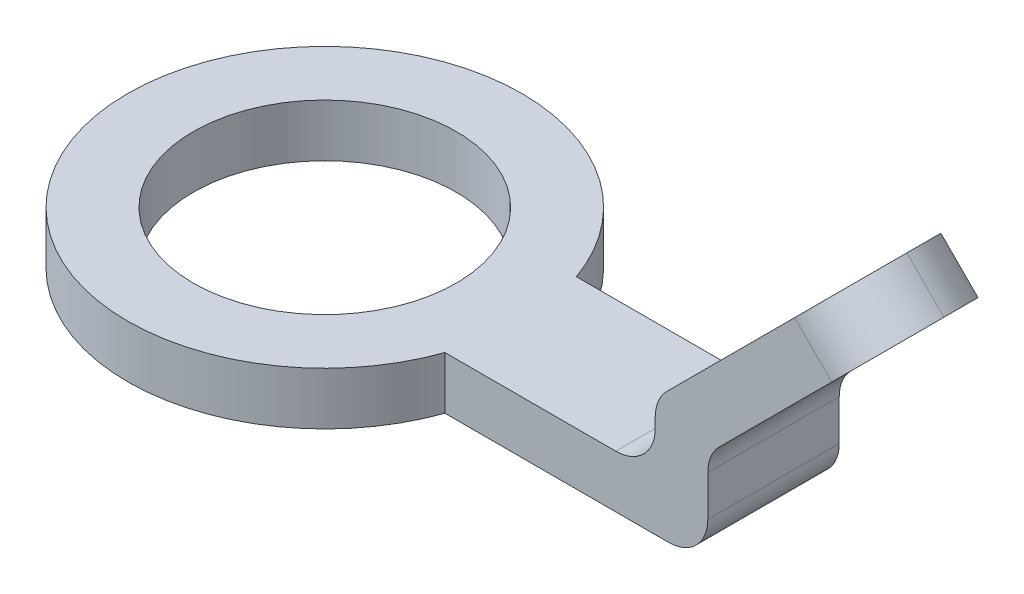
ISO-10303-21;
HEADER;
FILE_DESCRIPTION(('STEP AP214'),'2;1');
FILE_NAME('part.step','',(''),(''),'','','');
FILE_SCHEMA(('AUTOMOTIVE_DESIGN { 1 0 10303 214 1 1 1 1 }'));
ENDSEC;
DATA;
#1=APPLICATION_CONTEXT('core data for automotive mechanical design processes');
#2=APPLICATION_PROTOCOL_DEFINITION('international standard','automotive_design',2000,#1);
#3=PRODUCT_CONTEXT('',#1,'mechanical');
#4=PRODUCT('Part','Part','',(#3));
#5=PRODUCT_RELATED_PRODUCT_CATEGORY('part','',(#4));
#6=PRODUCT_DEFINITION_FORMATION('','',#4);
#7=PRODUCT_DEFINITION_CONTEXT('part definition',#1,'design');
#8=PRODUCT_DEFINITION('design','',#6,#7);
#9=PRODUCT_DEFINITION_SHAPE('','',#8);
#10=(LENGTH_UNIT() NAMED_UNIT(*) SI_UNIT(.MILLI.,.METRE.));
#11=(NAMED_UNIT(*) PLANE_ANGLE_UNIT() SI_UNIT($,.RADIAN.));
#12=(NAMED_UNIT(*) SI_UNIT($,.STERADIAN.) SOLID_ANGLE_UNIT());
#13=UNCERTAINTY_MEASURE_WITH_UNIT(LENGTH_MEASURE(1.E-05),#10,'distance_accuracy_value','');
#14=(GEOMETRIC_REPRESENTATION_CONTEXT(3) GLOBAL_UNCERTAINTY_ASSIGNED_CONTEXT((#13)) GLOBAL_UNIT_ASSIGNED_CONTEXT((#10,
#11,#12)) REPRESENTATION_CONTEXT('',''));
#15=CARTESIAN_POINT('',(0.,0.,0.));
#16=DIRECTION('',(0.,0.,1.));
#17=DIRECTION('',(1.,0.,0.));
#18=AXIS2_PLACEMENT_3D('',#15,#16,#17);
#19=CARTESIAN_POINT('',(0.,4.,0.));
#20=DIRECTION('',(0.,1.,0.));
#21=DIRECTION('',(0.,0.,1.));
#22=AXIS2_PLACEMENT_3D('',#19,#20,#21);
#23=PLANE('',#22);
#24=DIRECTION('',(1.,0.,0.));
#25=VECTOR('',#24,1.);
#26=CARTESIAN_POINT('',(34.142135623731,4.,5.));
#27=LINE('',#26,#25);
#28=CARTESIAN_POINT('',(14.1421356237309,4.,5.00000000000001));
#29=VERTEX_POINT('',#28);
#30=CARTESIAN_POINT('',(27.142135623731,4.,5.00000000000001));
#31=VERTEX_POINT('',#30);
#32=EDGE_CURVE('E147',#29,#31,#27,.T.);
#33=ORIENTED_EDGE('',*,*,#32,.T.);
#34=DIRECTION('',(0.,0.,1.));
#35=VECTOR('',#34,1.);
#36=CARTESIAN_POINT('',(27.142135623731,4.,-4.99999999999999));
#37=LINE('',#36,#35);
#38=CARTESIAN_POINT('',(27.142135623731,4.,-4.99999999999999));
#39=VERTEX_POINT('',#38);
#40=EDGE_CURVE('E54',#31,#39,#37,.F.);
#41=ORIENTED_EDGE('',*,*,#40,.T.);
#42=DIRECTION('',(-1.,0.,0.));
#43=VECTOR('',#42,1.);
#44=CARTESIAN_POINT('',(34.142135623731,4.,-4.99999999999999));
#45=LINE('',#44,#43);
#46=CARTESIAN_POINT('',(14.142135623731,4.,-4.99999999999999));
#47=VERTEX_POINT('',#46);
#48=EDGE_CURVE('E131',#39,#47,#45,.T.);
#49=ORIENTED_EDGE('',*,*,#48,.T.);
#50=CARTESIAN_POINT('',(0.,4.,0.));
#51=DIRECTION('',(0.,1.,0.));
#52=DIRECTION('',(0.,0.,1.));
#53=AXIS2_PLACEMENT_3D('',#50,#51,#52);
#54=CIRCLE('',#53,15.);
#55=EDGE_CURVE('E134',#47,#29,#54,.T.);
#56=ORIENTED_EDGE('',*,*,#55,.T.);
#57=EDGE_LOOP('',(#33,#41,#49,#56));
#58=FACE_BOUND('',#57,.T.);
#59=CARTESIAN_POINT('',(0.,4.,0.));
#60=DIRECTION('',(0.,1.,0.));
#61=DIRECTION('',(0.,0.,1.));
#62=AXIS2_PLACEMENT_3D('',#59,#60,#61);
#63=CIRCLE('',#62,10.);
#64=CARTESIAN_POINT('',(0.,4.,10.));
#65=VERTEX_POINT('',#64);
#66=EDGE_CURVE('E229',#65,#65,#63,.T.);
#67=ORIENTED_EDGE('',*,*,#66,.F.);
#68=EDGE_LOOP('',(#67));
#69=FACE_BOUND('',#68,.T.);
#70=ADVANCED_FACE('F39',(#58,#69),#23,.T.);
#71=CARTESIAN_POINT('',(0.,0.,0.));
#72=DIRECTION('',(0.,1.,0.));
#73=DIRECTION('',(0.,0.,1.));
#74=AXIS2_PLACEMENT_3D('',#71,#72,#73);
#75=PLANE('',#74);
#76=DIRECTION('',(-1.,0.,0.));
#77=VECTOR('',#76,1.);
#78=CARTESIAN_POINT('',(34.142135623731,0.,-4.99999999999999));
#79=LINE('',#78,#77);
#80=CARTESIAN_POINT('',(31.142135623731,0.,-4.99999999999999));
#81=VERTEX_POINT('',#80);
#82=CARTESIAN_POINT('',(14.142135623731,0.,-4.99999999999999));
#83=VERTEX_POINT('',#82);
#84=EDGE_CURVE('E151',#81,#83,#79,.T.);
#85=ORIENTED_EDGE('',*,*,#84,.F.);
#86=DIRECTION('',(0.,0.,-1.));
#87=VECTOR('',#86,1.);
#88=CARTESIAN_POINT('',(31.142135623731,0.,0.));
#89=LINE('',#88,#87);
#90=CARTESIAN_POINT('',(31.142135623731,0.,5.));
#91=VERTEX_POINT('',#90);
#92=EDGE_CURVE('E203',#81,#91,#89,.F.);
#93=ORIENTED_EDGE('',*,*,#92,.T.);
#94=DIRECTION('',(1.,0.,0.));
#95=VECTOR('',#94,1.);
#96=CARTESIAN_POINT('',(34.142135623731,0.,5.));
#97=LINE('',#96,#95);
#98=CARTESIAN_POINT('',(14.1421356237309,0.,5.00000000000001));
#99=VERTEX_POINT('',#98);
#100=EDGE_CURVE('E138',#99,#91,#97,.T.);
#101=ORIENTED_EDGE('',*,*,#100,.F.);
#102=CARTESIAN_POINT('',(0.,0.,0.));
#103=DIRECTION('',(0.,1.,0.));
#104=DIRECTION('',(0.,0.,1.));
#105=AXIS2_PLACEMENT_3D('',#102,#103,#104);
#106=CIRCLE('',#105,15.);
#107=EDGE_CURVE('E243',#83,#99,#106,.T.);
#108=ORIENTED_EDGE('',*,*,#107,.F.);
#109=EDGE_LOOP('',(#85,#93,#101,#108));
#110=FACE_BOUND('',#109,.T.);
#111=CARTESIAN_POINT('',(0.,0.,0.));
#112=DIRECTION('',(0.,1.,0.));
#113=DIRECTION('',(0.,0.,1.));
#114=AXIS2_PLACEMENT_3D('',#111,#112,#113);
#115=CIRCLE('',#114,10.);
#116=CARTESIAN_POINT('',(0.,0.,10.));
#117=VERTEX_POINT('',#116);
#118=EDGE_CURVE('E225',#117,#117,#115,.T.);
#119=ORIENTED_EDGE('',*,*,#118,.T.);
#120=EDGE_LOOP('',(#119));
#121=FACE_BOUND('',#120,.T.);
#122=ADVANCED_FACE('F260',(#110,#121),#75,.F.);
#123=CARTESIAN_POINT('',(34.142135623731,4.,-4.99999999999999));
#124=DIRECTION('',(0.,0.,1.));
#125=DIRECTION('',(1.,0.,0.));
#126=AXIS2_PLACEMENT_3D('',#123,#124,#125);
#127=PLANE('',#126);
#128=DIRECTION('',(0.,-1.,0.));
#129=VECTOR('',#128,1.);
#130=CARTESIAN_POINT('',(30.142135623731,9.,-4.99999999999999));
#131=LINE('',#130,#129);
#132=CARTESIAN_POINT('',(30.142135623731,7.75735931288071,-4.99999999999999));
#133=VERTEX_POINT('',#132);
#134=CARTESIAN_POINT('',(30.142135623731,7.,-4.99999999999999));
#135=VERTEX_POINT('',#134);
#136=EDGE_CURVE('E220',#133,#135,#131,.T.);
#137=ORIENTED_EDGE('',*,*,#136,.F.);
#138=CARTESIAN_POINT('',(33.142135623731,7.75735931288071,-4.99999999999999));
#139=DIRECTION('',(0.,0.,1.));
#140=DIRECTION('',(1.,0.,0.));
#141=AXIS2_PLACEMENT_3D('',#138,#139,#140);
#142=CIRCLE('',#141,3.);
#143=CARTESIAN_POINT('',(31.0208152801713,9.87867965644036,-4.99999999999999));
#144=VERTEX_POINT('',#143);
#145=EDGE_CURVE('E201',#133,#144,#142,.F.);
#146=ORIENTED_EDGE('',*,*,#145,.T.);
#147=DIRECTION('',(-0.707106781186548,-0.707106781186547,0.));
#148=VECTOR('',#147,1.);
#149=CARTESIAN_POINT('',(44.2842712474619,23.1421356237309,-4.99999999999999));
#150=LINE('',#149,#148);
#151=CARTESIAN_POINT('',(40.7487373415292,19.6066017177982,-4.99999999999999));
#152=VERTEX_POINT('',#151);
#153=EDGE_CURVE('E226',#152,#144,#150,.T.);
#154=ORIENTED_EDGE('',*,*,#153,.F.);
#155=DIRECTION('',(-0.707106781186545,0.70710678118655,0.));
#156=VECTOR('',#155,1.);
#157=CARTESIAN_POINT('',(43.5771644662754,16.778174593052,-5.));
#158=LINE('',#157,#156);
#159=CARTESIAN_POINT('',(43.5771644662754,16.778174593052,-4.99999999999999));
#160=VERTEX_POINT('',#159);
#161=EDGE_CURVE('E162',#152,#160,#158,.F.);
#162=ORIENTED_EDGE('',*,*,#161,.T.);
#163=DIRECTION('',(0.707106781186549,0.707106781186546,0.));
#164=VECTOR('',#163,1.);
#165=CARTESIAN_POINT('',(34.142135623731,7.34314575050764,-4.99999999999999));
#166=LINE('',#165,#164);
#167=CARTESIAN_POINT('',(35.0208152801713,8.22182540694801,-4.99999999999999));
#168=VERTEX_POINT('',#167);
#169=EDGE_CURVE('E232',#168,#160,#166,.T.);
#170=ORIENTED_EDGE('',*,*,#169,.F.);
#171=CARTESIAN_POINT('',(37.142135623731,6.10050506338836,-4.99999999999999));
#172=DIRECTION('',(0.,0.,1.));
#173=DIRECTION('',(1.,0.,0.));
#174=AXIS2_PLACEMENT_3D('',#171,#172,#173);
#175=CIRCLE('',#174,3.);
#176=CARTESIAN_POINT('',(34.142135623731,6.10050506338836,-4.99999999999999));
#177=VERTEX_POINT('',#176);
#178=EDGE_CURVE('E208',#168,#177,#175,.T.);
#179=ORIENTED_EDGE('',*,*,#178,.T.);
#180=DIRECTION('',(0.,-1.,0.));
#181=VECTOR('',#180,1.);
#182=CARTESIAN_POINT('',(34.142135623731,4.,-4.99999999999999));
#183=LINE('',#182,#181);
#184=CARTESIAN_POINT('',(34.142135623731,3.,-4.99999999999999));
#185=VERTEX_POINT('',#184);
#186=EDGE_CURVE('E217',#177,#185,#183,.T.);
#187=ORIENTED_EDGE('',*,*,#186,.T.);
#188=CARTESIAN_POINT('',(31.142135623731,3.,-4.99999999999999));
#189=DIRECTION('',(0.,0.,1.));
#190=DIRECTION('',(1.,0.,0.));
#191=AXIS2_PLACEMENT_3D('',#188,#189,#190);
#192=CIRCLE('',#191,3.);
#193=EDGE_CURVE('E62',#185,#81,#192,.F.);
#194=ORIENTED_EDGE('',*,*,#193,.T.);
#195=ORIENTED_EDGE('',*,*,#84,.T.);
#196=DIRECTION('',(0.,-1.,0.));
#197=VECTOR('',#196,1.);
#198=CARTESIAN_POINT('',(14.142135623731,4.,-4.99999999999999));
#199=LINE('',#198,#197);
#200=EDGE_CURVE('E143',#47,#83,#199,.T.);
#201=ORIENTED_EDGE('',*,*,#200,.F.);
#202=ORIENTED_EDGE('',*,*,#48,.F.);
#203=CARTESIAN_POINT('',(27.142135623731,7.,-4.99999999999999));
#204=DIRECTION('',(0.,0.,1.));
#205=DIRECTION('',(1.,0.,0.));
#206=AXIS2_PLACEMENT_3D('',#203,#204,#205);
#207=CIRCLE('',#206,3.);
#208=EDGE_CURVE('E11',#39,#135,#207,.T.);
#209=ORIENTED_EDGE('',*,*,#208,.T.);
#210=EDGE_LOOP('',(#137,#146,#154,#162,#170,#179,#187,#194,#195,#201,#202,#209));
#211=FACE_BOUND('',#210,.T.);
#212=ADVANCED_FACE('F150',(#211),#127,.F.);
#213=CARTESIAN_POINT('',(0.,4.,0.));
#214=DIRECTION('',(0.,-1.,0.));
#215=DIRECTION('',(0.,0.,-1.));
#216=AXIS2_PLACEMENT_3D('',#213,#214,#215);
#217=CYLINDRICAL_SURFACE('',#216,15.);
#218=ORIENTED_EDGE('',*,*,#107,.T.);
#219=DIRECTION('',(0.,-1.,0.));
#220=VECTOR('',#219,1.);
#221=CARTESIAN_POINT('',(14.1421356237309,4.,5.00000000000001));
#222=LINE('',#221,#220);
#223=EDGE_CURVE('E145',#29,#99,#222,.T.);
#224=ORIENTED_EDGE('',*,*,#223,.F.);
#225=ORIENTED_EDGE('',*,*,#55,.F.);
#226=ORIENTED_EDGE('',*,*,#200,.T.);
#227=EDGE_LOOP('',(#218,#224,#225,#226));
#228=FACE_BOUND('',#227,.T.);
#229=ADVANCED_FACE('F142',(#228),#217,.T.);
#230=CARTESIAN_POINT('',(34.142135623731,4.,5.));
#231=DIRECTION('',(0.,0.,-1.));
#232=DIRECTION('',(-1.,0.,0.));
#233=AXIS2_PLACEMENT_3D('',#230,#231,#232);
#234=PLANE('',#233);
#235=DIRECTION('',(-0.707106781186548,-0.707106781186547,0.));
#236=VECTOR('',#235,1.);
#237=CARTESIAN_POINT('',(44.2842712474619,23.1421356237309,5.00000000000001));
#238=LINE('',#237,#236);
#239=CARTESIAN_POINT('',(40.7487373415292,19.6066017177982,5.00000000000001));
#240=VERTEX_POINT('',#239);
#241=CARTESIAN_POINT('',(31.0208152801713,9.87867965644036,5.00000000000001));
#242=VERTEX_POINT('',#241);
#243=EDGE_CURVE('E237',#240,#242,#238,.T.);
#244=ORIENTED_EDGE('',*,*,#243,.T.);
#245=CARTESIAN_POINT('',(33.142135623731,7.75735931288071,5.));
#246=DIRECTION('',(0.,0.,-1.));
#247=DIRECTION('',(-1.,0.,0.));
#248=AXIS2_PLACEMENT_3D('',#245,#246,#247);
#249=CIRCLE('',#248,3.);
#250=CARTESIAN_POINT('',(30.142135623731,7.75735931288071,5.00000000000001));
#251=VERTEX_POINT('',#250);
#252=EDGE_CURVE('E193',#242,#251,#249,.F.);
#253=ORIENTED_EDGE('',*,*,#252,.T.);
#254=DIRECTION('',(0.,-1.,0.));
#255=VECTOR('',#254,1.);
#256=CARTESIAN_POINT('',(30.142135623731,9.,5.00000000000001));
#257=LINE('',#256,#255);
#258=CARTESIAN_POINT('',(30.142135623731,7.,5.00000000000001));
#259=VERTEX_POINT('',#258);
#260=EDGE_CURVE('E214',#251,#259,#257,.T.);
#261=ORIENTED_EDGE('',*,*,#260,.T.);
#262=CARTESIAN_POINT('',(27.142135623731,7.,5.00000000000001));
#263=DIRECTION('',(0.,0.,-1.));
#264=DIRECTION('',(-1.,0.,0.));
#265=AXIS2_PLACEMENT_3D('',#262,#263,#264);
#266=CIRCLE('',#265,3.);
#267=EDGE_CURVE('E47',#259,#31,#266,.T.);
#268=ORIENTED_EDGE('',*,*,#267,.T.);
#269=ORIENTED_EDGE('',*,*,#32,.F.);
#270=ORIENTED_EDGE('',*,*,#223,.T.);
#271=ORIENTED_EDGE('',*,*,#100,.T.);
#272=CARTESIAN_POINT('',(31.142135623731,3.,5.));
#273=DIRECTION('',(0.,0.,-1.));
#274=DIRECTION('',(-1.,0.,0.));
#275=AXIS2_PLACEMENT_3D('',#272,#273,#274);
#276=CIRCLE('',#275,3.);
#277=CARTESIAN_POINT('',(34.142135623731,3.,5.));
#278=VERTEX_POINT('',#277);
#279=EDGE_CURVE('E191',#91,#278,#276,.F.);
#280=ORIENTED_EDGE('',*,*,#279,.T.);
#281=DIRECTION('',(0.,-1.,0.));
#282=VECTOR('',#281,1.);
#283=CARTESIAN_POINT('',(34.142135623731,4.,5.));
#284=LINE('',#283,#282);
#285=CARTESIAN_POINT('',(34.142135623731,6.10050506338836,5.));
#286=VERTEX_POINT('',#285);
#287=EDGE_CURVE('E157',#286,#278,#284,.T.);
#288=ORIENTED_EDGE('',*,*,#287,.F.);
#289=CARTESIAN_POINT('',(37.142135623731,6.10050506338836,5.));
#290=DIRECTION('',(0.,0.,-1.));
#291=DIRECTION('',(-1.,0.,0.));
#292=AXIS2_PLACEMENT_3D('',#289,#290,#291);
#293=CIRCLE('',#292,3.);
#294=CARTESIAN_POINT('',(35.0208152801713,8.22182540694801,5.00000000000001));
#295=VERTEX_POINT('',#294);
#296=EDGE_CURVE('E206',#286,#295,#293,.T.);
#297=ORIENTED_EDGE('',*,*,#296,.T.);
#298=DIRECTION('',(0.707106781186549,0.707106781186546,0.));
#299=VECTOR('',#298,1.);
#300=CARTESIAN_POINT('',(34.142135623731,7.34314575050764,5.00000000000001));
#301=LINE('',#300,#299);
#302=CARTESIAN_POINT('',(43.5771644662754,16.778174593052,5.00000000000001));
#303=VERTEX_POINT('',#302);
#304=EDGE_CURVE('E176',#295,#303,#301,.T.);
#305=ORIENTED_EDGE('',*,*,#304,.T.);
#306=DIRECTION('',(-0.707106781186545,0.70710678118655,0.));
#307=VECTOR('',#306,1.);
#308=CARTESIAN_POINT('',(40.7487373415292,19.6066017177982,5.));
#309=LINE('',#308,#307);
#310=EDGE_CURVE('E170',#303,#240,#309,.T.);
#311=ORIENTED_EDGE('',*,*,#310,.T.);
#312=EDGE_LOOP('',(#244,#253,#261,#268,#269,#270,#271,#280,#288,#297,#305,#311));
#313=FACE_BOUND('',#312,.T.);
#314=ADVANCED_FACE('F212',(#313),#234,.F.);
#315=CARTESIAN_POINT('',(34.142135623731,4.,-4.99999999999999));
#316=DIRECTION('',(-1.,0.,0.));
#317=DIRECTION('',(0.,0.,1.));
#318=AXIS2_PLACEMENT_3D('',#315,#316,#317);
#319=PLANE('',#318);
#320=ORIENTED_EDGE('',*,*,#186,.F.);
#321=DIRECTION('',(0.,0.,1.));
#322=VECTOR('',#321,1.);
#323=CARTESIAN_POINT('',(34.142135623731,6.10050506338836,-4.99999999999999));
#324=LINE('',#323,#322);
#325=EDGE_CURVE('E183',#177,#286,#324,.T.);
#326=ORIENTED_EDGE('',*,*,#325,.T.);
#327=ORIENTED_EDGE('',*,*,#287,.T.);
#328=DIRECTION('',(0.,0.,-1.));
#329=VECTOR('',#328,1.);
#330=CARTESIAN_POINT('',(34.142135623731,3.,-4.99999999999999));
#331=LINE('',#330,#329);
#332=EDGE_CURVE('E172',#278,#185,#331,.T.);
#333=ORIENTED_EDGE('',*,*,#332,.T.);
#334=EDGE_LOOP('',(#320,#326,#327,#333));
#335=FACE_BOUND('',#334,.T.);
#336=ADVANCED_FACE('F252',(#335),#319,.F.);
#337=CARTESIAN_POINT('',(0.,4.,0.));
#338=DIRECTION('',(0.,-1.,0.));
#339=DIRECTION('',(0.,0.,-1.));
#340=AXIS2_PLACEMENT_3D('',#337,#338,#339);
#341=CYLINDRICAL_SURFACE('',#340,10.);
#342=ORIENTED_EDGE('',*,*,#66,.T.);
#343=EDGE_LOOP('',(#342));
#344=FACE_BOUND('',#343,.T.);
#345=ORIENTED_EDGE('',*,*,#118,.F.);
#346=EDGE_LOOP('',(#345));
#347=FACE_BOUND('',#346,.T.);
#348=ADVANCED_FACE('F266',(#344,#347),#341,.F.);
#349=CARTESIAN_POINT('',(30.142135623731,9.,-4.99999999999999));
#350=DIRECTION('',(-1.,0.,0.));
#351=DIRECTION('',(0.,0.,1.));
#352=AXIS2_PLACEMENT_3D('',#349,#350,#351);
#353=PLANE('',#352);
#354=ORIENTED_EDGE('',*,*,#260,.F.);
#355=DIRECTION('',(0.,0.,1.));
#356=VECTOR('',#355,1.);
#357=CARTESIAN_POINT('',(30.142135623731,7.75735931288071,-4.99999999999999));
#358=LINE('',#357,#356);
#359=EDGE_CURVE('E198',#251,#133,#358,.F.);
#360=ORIENTED_EDGE('',*,*,#359,.T.);
#361=ORIENTED_EDGE('',*,*,#136,.T.);
#362=DIRECTION('',(0.,0.,1.));
#363=VECTOR('',#362,1.);
#364=CARTESIAN_POINT('',(30.142135623731,7.,5.00000000000001));
#365=LINE('',#364,#363);
#366=EDGE_CURVE('E195',#135,#259,#365,.T.);
#367=ORIENTED_EDGE('',*,*,#366,.T.);
#368=EDGE_LOOP('',(#354,#360,#361,#367));
#369=FACE_BOUND('',#368,.T.);
#370=ADVANCED_FACE('F223',(#369),#353,.T.);
#371=CARTESIAN_POINT('',(44.2842712474619,23.1421356237309,-4.99999999999999));
#372=DIRECTION('',(-0.707106781186547,0.707106781186548,0.));
#373=DIRECTION('',(-0.707106781186548,-0.707106781186547,0.));
#374=AXIS2_PLACEMENT_3D('',#371,#372,#373);
#375=PLANE('',#374);
#376=CARTESIAN_POINT('',(40.7487373415292,19.6066017177982,0.));
#377=DIRECTION('',(-0.707106781186547,0.707106781186549,0.));
#378=DIRECTION('',(-0.707106781186549,-0.707106781186547,0.));
#379=AXIS2_PLACEMENT_3D('',#376,#377,#378);
#380=CIRCLE('',#379,1.8);
#381=CARTESIAN_POINT('',(39.4759451353934,18.3338095116624,0.));
#382=VERTEX_POINT('',#381);
#383=EDGE_CURVE('E180',#382,#382,#380,.T.);
#384=ORIENTED_EDGE('',*,*,#383,.F.);
#385=EDGE_LOOP('',(#384));
#386=FACE_BOUND('',#385,.T.);
#387=ORIENTED_EDGE('',*,*,#153,.T.);
#388=DIRECTION('',(0.,0.,1.));
#389=VECTOR('',#388,1.);
#390=CARTESIAN_POINT('',(31.0208152801713,9.87867965644036,-4.99999999999999));
#391=LINE('',#390,#389);
#392=EDGE_CURVE('E188',#144,#242,#391,.T.);
#393=ORIENTED_EDGE('',*,*,#392,.T.);
#394=ORIENTED_EDGE('',*,*,#243,.F.);
#395=CARTESIAN_POINT('',(40.7487373415292,19.6066017177982,0.));
#396=DIRECTION('',(-0.707106781186547,0.707106781186548,0.));
#397=DIRECTION('',(-0.707106781186548,-0.707106781186547,0.));
#398=AXIS2_PLACEMENT_3D('',#395,#396,#397);
#399=CIRCLE('',#398,5.);
#400=CARTESIAN_POINT('',(44.2842712474619,23.1421356237309,0.));
#401=VERTEX_POINT('',#400);
#402=EDGE_CURVE('E153',#240,#401,#399,.T.);
#403=ORIENTED_EDGE('',*,*,#402,.T.);
#404=CARTESIAN_POINT('',(40.7487373415292,19.6066017177982,0.));
#405=DIRECTION('',(-0.707106781186547,0.707106781186548,0.));
#406=DIRECTION('',(-0.707106781186548,-0.707106781186547,0.));
#407=AXIS2_PLACEMENT_3D('',#404,#405,#406);
#408=CIRCLE('',#407,5.);
#409=EDGE_CURVE('E155',#401,#152,#408,.T.);
#410=ORIENTED_EDGE('',*,*,#409,.T.);
#411=EDGE_LOOP('',(#387,#393,#394,#403,#410));
#412=FACE_BOUND('',#411,.T.);
#413=ADVANCED_FACE('F275',(#386,#412),#375,.T.);
#414=CARTESIAN_POINT('',(34.142135623731,7.34314575050764,-4.99999999999999));
#415=DIRECTION('',(0.707106781186546,-0.707106781186549,0.));
#416=DIRECTION('',(0.707106781186549,0.707106781186546,0.));
#417=AXIS2_PLACEMENT_3D('',#414,#415,#416);
#418=PLANE('',#417);
#419=CARTESIAN_POINT('',(43.5771644662754,16.778174593052,0.));
#420=DIRECTION('',(0.707106781186546,-0.707106781186549,0.));
#421=DIRECTION('',(0.707106781186549,0.707106781186546,0.));
#422=AXIS2_PLACEMENT_3D('',#419,#420,#421);
#423=CIRCLE('',#422,1.8);
#424=CARTESIAN_POINT('',(44.8499566724112,18.0509667991878,0.));
#425=VERTEX_POINT('',#424);
#426=EDGE_CURVE('E177',#425,#425,#423,.T.);
#427=ORIENTED_EDGE('',*,*,#426,.F.);
#428=EDGE_LOOP('',(#427));
#429=FACE_BOUND('',#428,.T.);
#430=ORIENTED_EDGE('',*,*,#304,.F.);
#431=DIRECTION('',(0.,0.,1.));
#432=VECTOR('',#431,1.);
#433=CARTESIAN_POINT('',(35.0208152801713,8.22182540694801,-4.99999999999999));
#434=LINE('',#433,#432);
#435=EDGE_CURVE('E186',#295,#168,#434,.F.);
#436=ORIENTED_EDGE('',*,*,#435,.T.);
#437=ORIENTED_EDGE('',*,*,#169,.T.);
#438=CARTESIAN_POINT('',(43.5771644662754,16.778174593052,0.));
#439=DIRECTION('',(0.707106781186546,-0.707106781186549,0.));
#440=DIRECTION('',(0.707106781186549,0.707106781186546,0.));
#441=AXIS2_PLACEMENT_3D('',#438,#439,#440);
#442=CIRCLE('',#441,5.);
#443=CARTESIAN_POINT('',(47.1126983722081,20.3137084989847,0.));
#444=VERTEX_POINT('',#443);
#445=EDGE_CURVE('E168',#160,#444,#442,.T.);
#446=ORIENTED_EDGE('',*,*,#445,.T.);
#447=CARTESIAN_POINT('',(43.5771644662754,16.778174593052,0.));
#448=DIRECTION('',(0.707106781186546,-0.707106781186549,0.));
#449=DIRECTION('',(0.707106781186549,0.707106781186546,0.));
#450=AXIS2_PLACEMENT_3D('',#447,#448,#449);
#451=CIRCLE('',#450,5.);
#452=EDGE_CURVE('E165',#444,#303,#451,.T.);
#453=ORIENTED_EDGE('',*,*,#452,.T.);
#454=EDGE_LOOP('',(#430,#436,#437,#446,#453));
#455=FACE_BOUND('',#454,.T.);
#456=ADVANCED_FACE('F298',(#429,#455),#418,.T.);
#457=CARTESIAN_POINT('',(45.2487373415292,15.1066017177982,0.));
#458=DIRECTION('',(0.707106781186545,-0.70710678118655,0.));
#459=DIRECTION('',(0.70710678118655,0.707106781186545,0.));
#460=AXIS2_PLACEMENT_3D('',#457,#458,#459);
#461=CYLINDRICAL_SURFACE('',#460,5.);
#462=ORIENTED_EDGE('',*,*,#310,.F.);
#463=ORIENTED_EDGE('',*,*,#452,.F.);
#464=DIRECTION('',(-0.707106781186545,0.70710678118655,0.));
#465=VECTOR('',#464,1.);
#466=CARTESIAN_POINT('',(47.1126983722081,20.3137084989847,0.));
#467=LINE('',#466,#465);
#468=EDGE_CURVE('E173',#401,#444,#467,.F.);
#469=ORIENTED_EDGE('',*,*,#468,.F.);
#470=ORIENTED_EDGE('',*,*,#402,.F.);
#471=EDGE_LOOP('',(#462,#463,#469,#470));
#472=FACE_BOUND('',#471,.T.);
#473=ADVANCED_FACE('F295',(#472),#461,.T.);
#474=CARTESIAN_POINT('',(43.5771644662754,16.778174593052,0.));
#475=DIRECTION('',(0.707106781186545,-0.70710678118655,0.));
#476=DIRECTION('',(0.70710678118655,0.707106781186545,0.));
#477=AXIS2_PLACEMENT_3D('',#474,#475,#476);
#478=CYLINDRICAL_SURFACE('',#477,5.);
#479=ORIENTED_EDGE('',*,*,#445,.F.);
#480=ORIENTED_EDGE('',*,*,#161,.F.);
#481=ORIENTED_EDGE('',*,*,#409,.F.);
#482=ORIENTED_EDGE('',*,*,#468,.T.);
#483=EDGE_LOOP('',(#479,#480,#481,#482));
#484=FACE_BOUND('',#483,.T.);
#485=ADVANCED_FACE('F291',(#484),#478,.T.);
#486=CARTESIAN_POINT('',(40.7487373415292,19.6066017177982,0.));
#487=DIRECTION('',(-0.707106781186547,0.707106781186549,0.));
#488=DIRECTION('',(-0.707106781186549,-0.707106781186547,0.));
#489=AXIS2_PLACEMENT_3D('',#486,#487,#488);
#490=CYLINDRICAL_SURFACE('',#489,1.8);
#491=ORIENTED_EDGE('',*,*,#426,.T.);
#492=EDGE_LOOP('',(#491));
#493=FACE_BOUND('',#492,.T.);
#494=ORIENTED_EDGE('',*,*,#383,.T.);
#495=EDGE_LOOP('',(#494));
#496=FACE_BOUND('',#495,.T.);
#497=ADVANCED_FACE('F294',(#493,#496),#490,.F.);
#498=CARTESIAN_POINT('',(37.142135623731,6.10050506338836,-4.99999999999999));
#499=DIRECTION('',(0.,0.,1.));
#500=DIRECTION('',(1.,0.,0.));
#501=AXIS2_PLACEMENT_3D('',#498,#499,#500);
#502=CYLINDRICAL_SURFACE('',#501,3.);
#503=ORIENTED_EDGE('',*,*,#178,.F.);
#504=ORIENTED_EDGE('',*,*,#435,.F.);
#505=ORIENTED_EDGE('',*,*,#296,.F.);
#506=ORIENTED_EDGE('',*,*,#325,.F.);
#507=EDGE_LOOP('',(#503,#504,#505,#506));
#508=FACE_BOUND('',#507,.T.);
#509=ADVANCED_FACE('F300',(#508),#502,.F.);
#510=CARTESIAN_POINT('',(33.142135623731,7.75735931288071,-4.99999999999999));
#511=DIRECTION('',(0.,0.,1.));
#512=DIRECTION('',(1.,0.,0.));
#513=AXIS2_PLACEMENT_3D('',#510,#511,#512);
#514=CYLINDRICAL_SURFACE('',#513,3.);
#515=ORIENTED_EDGE('',*,*,#145,.F.);
#516=ORIENTED_EDGE('',*,*,#359,.F.);
#517=ORIENTED_EDGE('',*,*,#252,.F.);
#518=ORIENTED_EDGE('',*,*,#392,.F.);
#519=EDGE_LOOP('',(#515,#516,#517,#518));
#520=FACE_BOUND('',#519,.T.);
#521=ADVANCED_FACE('F303',(#520),#514,.T.);
#522=CARTESIAN_POINT('',(31.142135623731,3.,-4.99999999999999));
#523=DIRECTION('',(0.,0.,-1.));
#524=DIRECTION('',(-1.,0.,0.));
#525=AXIS2_PLACEMENT_3D('',#522,#523,#524);
#526=CYLINDRICAL_SURFACE('',#525,3.);
#527=ORIENTED_EDGE('',*,*,#279,.F.);
#528=ORIENTED_EDGE('',*,*,#92,.F.);
#529=ORIENTED_EDGE('',*,*,#193,.F.);
#530=ORIENTED_EDGE('',*,*,#332,.F.);
#531=EDGE_LOOP('',(#527,#528,#529,#530));
#532=FACE_BOUND('',#531,.T.);
#533=ADVANCED_FACE('F256',(#532),#526,.T.);
#534=CARTESIAN_POINT('',(27.142135623731,7.,-4.99999999999999));
#535=DIRECTION('',(0.,0.,-1.));
#536=DIRECTION('',(-1.,0.,0.));
#537=AXIS2_PLACEMENT_3D('',#534,#535,#536);
#538=CYLINDRICAL_SURFACE('',#537,3.);
#539=ORIENTED_EDGE('',*,*,#208,.F.);
#540=ORIENTED_EDGE('',*,*,#40,.F.);
#541=ORIENTED_EDGE('',*,*,#267,.F.);
#542=ORIENTED_EDGE('',*,*,#366,.F.);
#543=EDGE_LOOP('',(#539,#540,#541,#542));
#544=FACE_BOUND('',#543,.T.);
#545=ADVANCED_FACE('F41',(#544),#538,.F.);
#546=CLOSED_SHELL('',(#70,#122,#212,#229,#314,#336,#348,#370,#413,#456,#473,#485,#497,#509,#521,
#533,#545));
#547=MANIFOLD_SOLID_BREP('B2',#546);
#548=ADVANCED_BREP_SHAPE_REPRESENTATION('',(#18,#547),#14);
#549=SHAPE_DEFINITION_REPRESENTATION(#9,#548);
ENDSEC;
END-ISO-10303-21;
